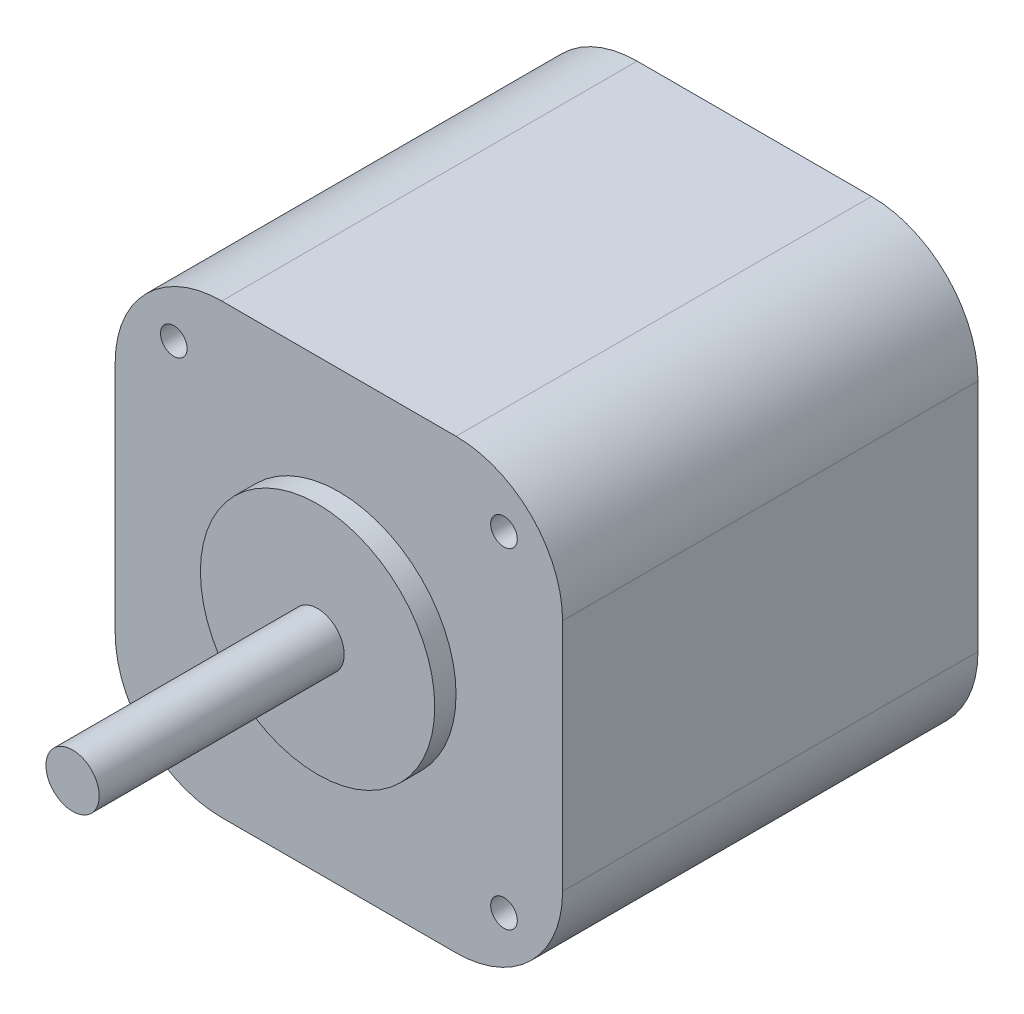
ISO-10303-21;
HEADER;
FILE_DESCRIPTION(('STEP AP214'),'2;1');
FILE_NAME('part.step','',(''),(''),'','','');
FILE_SCHEMA(('AUTOMOTIVE_DESIGN { 1 0 10303 214 1 1 1 1 }'));
ENDSEC;
DATA;
#1=APPLICATION_CONTEXT('core data for automotive mechanical design processes');
#2=APPLICATION_PROTOCOL_DEFINITION('international standard','automotive_design',2000,#1);
#3=PRODUCT_CONTEXT('',#1,'mechanical');
#4=PRODUCT('Part','Part','',(#3));
#5=PRODUCT_RELATED_PRODUCT_CATEGORY('part','',(#4));
#6=PRODUCT_DEFINITION_FORMATION('','',#4);
#7=PRODUCT_DEFINITION_CONTEXT('part definition',#1,'design');
#8=PRODUCT_DEFINITION('design','',#6,#7);
#9=PRODUCT_DEFINITION_SHAPE('','',#8);
#10=(LENGTH_UNIT() NAMED_UNIT(*) SI_UNIT(.MILLI.,.METRE.));
#11=(NAMED_UNIT(*) PLANE_ANGLE_UNIT() SI_UNIT($,.RADIAN.));
#12=(NAMED_UNIT(*) SI_UNIT($,.STERADIAN.) SOLID_ANGLE_UNIT());
#13=UNCERTAINTY_MEASURE_WITH_UNIT(LENGTH_MEASURE(1.E-05),#10,'distance_accuracy_value','');
#14=(GEOMETRIC_REPRESENTATION_CONTEXT(3) GLOBAL_UNCERTAINTY_ASSIGNED_CONTEXT((#13)) GLOBAL_UNIT_ASSIGNED_CONTEXT((#10,
#11,#12)) REPRESENTATION_CONTEXT('',''));
#15=CARTESIAN_POINT('',(0.,0.,0.));
#16=DIRECTION('',(0.,0.,1.));
#17=DIRECTION('',(1.,0.,0.));
#18=AXIS2_PLACEMENT_3D('',#15,#16,#17);
#19=CARTESIAN_POINT('',(0.,0.,39.));
#20=DIRECTION('',(1.,0.,0.));
#21=DIRECTION('',(0.,0.,-1.));
#22=AXIS2_PLACEMENT_3D('',#19,#20,#21);
#23=PLANE('',#22);
#24=DIRECTION('',(0.,-1.,0.));
#25=VECTOR('',#24,1.);
#26=CARTESIAN_POINT('',(0.,0.,0.));
#27=LINE('',#26,#25);
#28=CARTESIAN_POINT('',(0.,32.,0.));
#29=VERTEX_POINT('',#28);
#30=CARTESIAN_POINT('',(0.,10.,0.));
#31=VERTEX_POINT('',#30);
#32=EDGE_CURVE('E150',#29,#31,#27,.T.);
#33=ORIENTED_EDGE('',*,*,#32,.T.);
#34=DIRECTION('',(0.,0.,-1.));
#35=VECTOR('',#34,1.);
#36=CARTESIAN_POINT('',(0.,10.,39.));
#37=LINE('',#36,#35);
#38=CARTESIAN_POINT('',(0.,10.,39.));
#39=VERTEX_POINT('',#38);
#40=EDGE_CURVE('E187',#31,#39,#37,.F.);
#41=ORIENTED_EDGE('',*,*,#40,.T.);
#42=DIRECTION('',(0.,-1.,0.));
#43=VECTOR('',#42,1.);
#44=CARTESIAN_POINT('',(0.,0.,39.));
#45=LINE('',#44,#43);
#46=CARTESIAN_POINT('',(0.,32.,39.));
#47=VERTEX_POINT('',#46);
#48=EDGE_CURVE('E151',#47,#39,#45,.T.);
#49=ORIENTED_EDGE('',*,*,#48,.F.);
#50=DIRECTION('',(0.,0.,-1.));
#51=VECTOR('',#50,1.);
#52=CARTESIAN_POINT('',(0.,32.,39.));
#53=LINE('',#52,#51);
#54=EDGE_CURVE('E184',#47,#29,#53,.T.);
#55=ORIENTED_EDGE('',*,*,#54,.T.);
#56=EDGE_LOOP('',(#33,#41,#49,#55));
#57=FACE_BOUND('',#56,.T.);
#58=ADVANCED_FACE('F39',(#57),#23,.F.);
#59=CARTESIAN_POINT('',(0.,0.,39.));
#60=DIRECTION('',(0.,1.,0.));
#61=DIRECTION('',(0.,0.,1.));
#62=AXIS2_PLACEMENT_3D('',#59,#60,#61);
#63=PLANE('',#62);
#64=DIRECTION('',(1.,0.,0.));
#65=VECTOR('',#64,1.);
#66=CARTESIAN_POINT('',(0.,0.,39.));
#67=LINE('',#66,#65);
#68=CARTESIAN_POINT('',(10.,0.,39.));
#69=VERTEX_POINT('',#68);
#70=CARTESIAN_POINT('',(32.,0.,39.));
#71=VERTEX_POINT('',#70);
#72=EDGE_CURVE('E154',#69,#71,#67,.T.);
#73=ORIENTED_EDGE('',*,*,#72,.F.);
#74=DIRECTION('',(0.,0.,-1.));
#75=VECTOR('',#74,1.);
#76=CARTESIAN_POINT('',(10.,0.,39.));
#77=LINE('',#76,#75);
#78=CARTESIAN_POINT('',(10.,0.,0.));
#79=VERTEX_POINT('',#78);
#80=EDGE_CURVE('E173',#69,#79,#77,.T.);
#81=ORIENTED_EDGE('',*,*,#80,.T.);
#82=DIRECTION('',(1.,0.,0.));
#83=VECTOR('',#82,1.);
#84=CARTESIAN_POINT('',(0.,0.,0.));
#85=LINE('',#84,#83);
#86=CARTESIAN_POINT('',(32.,0.,0.));
#87=VERTEX_POINT('',#86);
#88=EDGE_CURVE('E165',#79,#87,#85,.T.);
#89=ORIENTED_EDGE('',*,*,#88,.T.);
#90=DIRECTION('',(0.,0.,-1.));
#91=VECTOR('',#90,1.);
#92=CARTESIAN_POINT('',(32.,0.,39.));
#93=LINE('',#92,#91);
#94=EDGE_CURVE('E162',#87,#71,#93,.F.);
#95=ORIENTED_EDGE('',*,*,#94,.T.);
#96=EDGE_LOOP('',(#73,#81,#89,#95));
#97=FACE_BOUND('',#96,.T.);
#98=ADVANCED_FACE('F226',(#97),#63,.F.);
#99=CARTESIAN_POINT('',(42.,0.,39.));
#100=DIRECTION('',(-1.,0.,0.));
#101=DIRECTION('',(0.,0.,1.));
#102=AXIS2_PLACEMENT_3D('',#99,#100,#101);
#103=PLANE('',#102);
#104=DIRECTION('',(0.,1.,0.));
#105=VECTOR('',#104,1.);
#106=CARTESIAN_POINT('',(42.,0.,39.));
#107=LINE('',#106,#105);
#108=CARTESIAN_POINT('',(42.,10.,39.));
#109=VERTEX_POINT('',#108);
#110=CARTESIAN_POINT('',(42.,32.,39.));
#111=VERTEX_POINT('',#110);
#112=EDGE_CURVE('E158',#109,#111,#107,.T.);
#113=ORIENTED_EDGE('',*,*,#112,.F.);
#114=DIRECTION('',(0.,0.,-1.));
#115=VECTOR('',#114,1.);
#116=CARTESIAN_POINT('',(42.,10.,39.));
#117=LINE('',#116,#115);
#118=CARTESIAN_POINT('',(42.,10.,0.));
#119=VERTEX_POINT('',#118);
#120=EDGE_CURVE('E198',#109,#119,#117,.T.);
#121=ORIENTED_EDGE('',*,*,#120,.T.);
#122=DIRECTION('',(0.,1.,0.));
#123=VECTOR('',#122,1.);
#124=CARTESIAN_POINT('',(42.,0.,0.));
#125=LINE('',#124,#123);
#126=CARTESIAN_POINT('',(42.,32.,0.));
#127=VERTEX_POINT('',#126);
#128=EDGE_CURVE('E168',#119,#127,#125,.T.);
#129=ORIENTED_EDGE('',*,*,#128,.T.);
#130=DIRECTION('',(0.,0.,-1.));
#131=VECTOR('',#130,1.);
#132=CARTESIAN_POINT('',(42.,32.,39.));
#133=LINE('',#132,#131);
#134=EDGE_CURVE('E196',#127,#111,#133,.F.);
#135=ORIENTED_EDGE('',*,*,#134,.T.);
#136=EDGE_LOOP('',(#113,#121,#129,#135));
#137=FACE_BOUND('',#136,.T.);
#138=ADVANCED_FACE('F234',(#137),#103,.F.);
#139=CARTESIAN_POINT('',(0.,42.,39.));
#140=DIRECTION('',(0.,-1.,0.));
#141=DIRECTION('',(0.,0.,-1.));
#142=AXIS2_PLACEMENT_3D('',#139,#140,#141);
#143=PLANE('',#142);
#144=DIRECTION('',(-1.,0.,0.));
#145=VECTOR('',#144,1.);
#146=CARTESIAN_POINT('',(0.,42.,0.));
#147=LINE('',#146,#145);
#148=CARTESIAN_POINT('',(32.,42.,0.));
#149=VERTEX_POINT('',#148);
#150=CARTESIAN_POINT('',(10.,42.,0.));
#151=VERTEX_POINT('',#150);
#152=EDGE_CURVE('E155',#149,#151,#147,.T.);
#153=ORIENTED_EDGE('',*,*,#152,.T.);
#154=DIRECTION('',(0.,0.,-1.));
#155=VECTOR('',#154,1.);
#156=CARTESIAN_POINT('',(10.,42.,39.));
#157=LINE('',#156,#155);
#158=CARTESIAN_POINT('',(10.,42.,39.));
#159=VERTEX_POINT('',#158);
#160=EDGE_CURVE('E47',#151,#159,#157,.F.);
#161=ORIENTED_EDGE('',*,*,#160,.T.);
#162=DIRECTION('',(-1.,0.,0.));
#163=VECTOR('',#162,1.);
#164=CARTESIAN_POINT('',(0.,42.,39.));
#165=LINE('',#164,#163);
#166=CARTESIAN_POINT('',(32.,42.,39.));
#167=VERTEX_POINT('',#166);
#168=EDGE_CURVE('E160',#167,#159,#165,.T.);
#169=ORIENTED_EDGE('',*,*,#168,.F.);
#170=DIRECTION('',(0.,0.,-1.));
#171=VECTOR('',#170,1.);
#172=CARTESIAN_POINT('',(32.,42.,39.));
#173=LINE('',#172,#171);
#174=EDGE_CURVE('E201',#167,#149,#173,.T.);
#175=ORIENTED_EDGE('',*,*,#174,.T.);
#176=EDGE_LOOP('',(#153,#161,#169,#175));
#177=FACE_BOUND('',#176,.T.);
#178=ADVANCED_FACE('F205',(#177),#143,.F.);
#179=CARTESIAN_POINT('',(0.,0.,39.));
#180=DIRECTION('',(0.,0.,-1.));
#181=DIRECTION('',(-1.,0.,0.));
#182=AXIS2_PLACEMENT_3D('',#179,#180,#181);
#183=PLANE('',#182);
#184=CARTESIAN_POINT('',(21.,21.,39.));
#185=DIRECTION('',(0.,0.,-1.));
#186=DIRECTION('',(-1.,0.,0.));
#187=AXIS2_PLACEMENT_3D('',#184,#185,#186);
#188=CIRCLE('',#187,11.);
#189=CARTESIAN_POINT('',(10.,21.,39.));
#190=VERTEX_POINT('',#189);
#191=EDGE_CURVE('E11',#190,#190,#188,.F.);
#192=ORIENTED_EDGE('',*,*,#191,.F.);
#193=EDGE_LOOP('',(#192));
#194=FACE_BOUND('',#193,.T.);
#195=CARTESIAN_POINT('',(5.5,36.5,39.));
#196=DIRECTION('',(0.,0.,1.));
#197=DIRECTION('',(1.,0.,0.));
#198=AXIS2_PLACEMENT_3D('',#195,#196,#197);
#199=CIRCLE('',#198,1.24999999999999);
#200=CARTESIAN_POINT('',(6.74999999999998,36.5,39.));
#201=VERTEX_POINT('',#200);
#202=EDGE_CURVE('E126',#201,#201,#199,.T.);
#203=ORIENTED_EDGE('',*,*,#202,.F.);
#204=EDGE_LOOP('',(#203));
#205=FACE_BOUND('',#204,.T.);
#206=CARTESIAN_POINT('',(36.5,36.5,39.));
#207=DIRECTION('',(0.,0.,1.));
#208=DIRECTION('',(1.,0.,0.));
#209=AXIS2_PLACEMENT_3D('',#206,#207,#208);
#210=CIRCLE('',#209,1.24999999999999);
#211=CARTESIAN_POINT('',(37.75,36.5,39.));
#212=VERTEX_POINT('',#211);
#213=EDGE_CURVE('E125',#212,#212,#210,.T.);
#214=ORIENTED_EDGE('',*,*,#213,.F.);
#215=EDGE_LOOP('',(#214));
#216=FACE_BOUND('',#215,.T.);
#217=CARTESIAN_POINT('',(36.5,5.50000000000001,39.));
#218=DIRECTION('',(0.,0.,1.));
#219=DIRECTION('',(1.,0.,0.));
#220=AXIS2_PLACEMENT_3D('',#217,#218,#219);
#221=CIRCLE('',#220,1.24999999999999);
#222=CARTESIAN_POINT('',(37.75,5.50000000000001,39.));
#223=VERTEX_POINT('',#222);
#224=EDGE_CURVE('E138',#223,#223,#221,.T.);
#225=ORIENTED_EDGE('',*,*,#224,.F.);
#226=EDGE_LOOP('',(#225));
#227=FACE_BOUND('',#226,.T.);
#228=CARTESIAN_POINT('',(5.5,5.5,39.));
#229=DIRECTION('',(0.,0.,1.));
#230=DIRECTION('',(1.,0.,0.));
#231=AXIS2_PLACEMENT_3D('',#228,#229,#230);
#232=CIRCLE('',#231,1.24999999999999);
#233=CARTESIAN_POINT('',(6.74999999999999,5.5,39.));
#234=VERTEX_POINT('',#233);
#235=EDGE_CURVE('E144',#234,#234,#232,.T.);
#236=ORIENTED_EDGE('',*,*,#235,.F.);
#237=EDGE_LOOP('',(#236));
#238=FACE_BOUND('',#237,.T.);
#239=ORIENTED_EDGE('',*,*,#48,.T.);
#240=CARTESIAN_POINT('',(10.,10.,39.));
#241=DIRECTION('',(0.,0.,-1.));
#242=DIRECTION('',(-1.,0.,0.));
#243=AXIS2_PLACEMENT_3D('',#240,#241,#242);
#244=CIRCLE('',#243,10.);
#245=EDGE_CURVE('E194',#39,#69,#244,.F.);
#246=ORIENTED_EDGE('',*,*,#245,.T.);
#247=ORIENTED_EDGE('',*,*,#72,.T.);
#248=CARTESIAN_POINT('',(32.,10.,39.));
#249=DIRECTION('',(0.,0.,-1.));
#250=DIRECTION('',(-1.,0.,0.));
#251=AXIS2_PLACEMENT_3D('',#248,#249,#250);
#252=CIRCLE('',#251,10.);
#253=EDGE_CURVE('E192',#71,#109,#252,.F.);
#254=ORIENTED_EDGE('',*,*,#253,.T.);
#255=ORIENTED_EDGE('',*,*,#112,.T.);
#256=CARTESIAN_POINT('',(32.,32.,39.));
#257=DIRECTION('',(0.,0.,-1.));
#258=DIRECTION('',(-1.,0.,0.));
#259=AXIS2_PLACEMENT_3D('',#256,#257,#258);
#260=CIRCLE('',#259,10.);
#261=EDGE_CURVE('E60',#111,#167,#260,.F.);
#262=ORIENTED_EDGE('',*,*,#261,.T.);
#263=ORIENTED_EDGE('',*,*,#168,.T.);
#264=CARTESIAN_POINT('',(10.,32.,39.));
#265=DIRECTION('',(0.,0.,-1.));
#266=DIRECTION('',(-1.,0.,0.));
#267=AXIS2_PLACEMENT_3D('',#264,#265,#266);
#268=CIRCLE('',#267,10.);
#269=EDGE_CURVE('E190',#159,#47,#268,.F.);
#270=ORIENTED_EDGE('',*,*,#269,.T.);
#271=EDGE_LOOP('',(#239,#246,#247,#254,#255,#262,#263,#270));
#272=FACE_BOUND('',#271,.T.);
#273=ADVANCED_FACE('F220',(#194,#205,#216,#227,#238,#272),#183,.F.);
#274=CARTESIAN_POINT('',(0.,0.,0.));
#275=DIRECTION('',(0.,0.,-1.));
#276=DIRECTION('',(-1.,0.,0.));
#277=AXIS2_PLACEMENT_3D('',#274,#275,#276);
#278=PLANE('',#277);
#279=ORIENTED_EDGE('',*,*,#88,.F.);
#280=CARTESIAN_POINT('',(10.,10.,0.));
#281=DIRECTION('',(0.,0.,-1.));
#282=DIRECTION('',(-1.,0.,0.));
#283=AXIS2_PLACEMENT_3D('',#280,#281,#282);
#284=CIRCLE('',#283,10.);
#285=EDGE_CURVE('E182',#79,#31,#284,.T.);
#286=ORIENTED_EDGE('',*,*,#285,.T.);
#287=ORIENTED_EDGE('',*,*,#32,.F.);
#288=CARTESIAN_POINT('',(10.,32.,0.));
#289=DIRECTION('',(0.,0.,-1.));
#290=DIRECTION('',(-1.,0.,0.));
#291=AXIS2_PLACEMENT_3D('',#288,#289,#290);
#292=CIRCLE('',#291,10.);
#293=EDGE_CURVE('E178',#29,#151,#292,.T.);
#294=ORIENTED_EDGE('',*,*,#293,.T.);
#295=ORIENTED_EDGE('',*,*,#152,.F.);
#296=CARTESIAN_POINT('',(32.,32.,0.));
#297=DIRECTION('',(0.,0.,-1.));
#298=DIRECTION('',(-1.,0.,0.));
#299=AXIS2_PLACEMENT_3D('',#296,#297,#298);
#300=CIRCLE('',#299,10.);
#301=EDGE_CURVE('E176',#149,#127,#300,.T.);
#302=ORIENTED_EDGE('',*,*,#301,.T.);
#303=ORIENTED_EDGE('',*,*,#128,.F.);
#304=CARTESIAN_POINT('',(32.,10.,0.));
#305=DIRECTION('',(0.,0.,-1.));
#306=DIRECTION('',(-1.,0.,0.));
#307=AXIS2_PLACEMENT_3D('',#304,#305,#306);
#308=CIRCLE('',#307,10.);
#309=EDGE_CURVE('E180',#119,#87,#308,.T.);
#310=ORIENTED_EDGE('',*,*,#309,.T.);
#311=EDGE_LOOP('',(#279,#286,#287,#294,#295,#302,#303,#310));
#312=FACE_BOUND('',#311,.T.);
#313=ADVANCED_FACE('F209',(#312),#278,.T.);
#314=CARTESIAN_POINT('',(10.,10.,39.));
#315=DIRECTION('',(0.,0.,-1.));
#316=DIRECTION('',(-1.,0.,0.));
#317=AXIS2_PLACEMENT_3D('',#314,#315,#316);
#318=CYLINDRICAL_SURFACE('',#317,10.);
#319=ORIENTED_EDGE('',*,*,#245,.F.);
#320=ORIENTED_EDGE('',*,*,#40,.F.);
#321=ORIENTED_EDGE('',*,*,#285,.F.);
#322=ORIENTED_EDGE('',*,*,#80,.F.);
#323=EDGE_LOOP('',(#319,#320,#321,#322));
#324=FACE_BOUND('',#323,.T.);
#325=ADVANCED_FACE('F224',(#324),#318,.T.);
#326=CARTESIAN_POINT('',(32.,10.,39.));
#327=DIRECTION('',(0.,0.,-1.));
#328=DIRECTION('',(-1.,0.,0.));
#329=AXIS2_PLACEMENT_3D('',#326,#327,#328);
#330=CYLINDRICAL_SURFACE('',#329,10.);
#331=ORIENTED_EDGE('',*,*,#253,.F.);
#332=ORIENTED_EDGE('',*,*,#94,.F.);
#333=ORIENTED_EDGE('',*,*,#309,.F.);
#334=ORIENTED_EDGE('',*,*,#120,.F.);
#335=EDGE_LOOP('',(#331,#332,#333,#334));
#336=FACE_BOUND('',#335,.T.);
#337=ADVANCED_FACE('F231',(#336),#330,.T.);
#338=CARTESIAN_POINT('',(10.,32.,39.));
#339=DIRECTION('',(0.,0.,-1.));
#340=DIRECTION('',(-1.,0.,0.));
#341=AXIS2_PLACEMENT_3D('',#338,#339,#340);
#342=CYLINDRICAL_SURFACE('',#341,10.);
#343=ORIENTED_EDGE('',*,*,#269,.F.);
#344=ORIENTED_EDGE('',*,*,#160,.F.);
#345=ORIENTED_EDGE('',*,*,#293,.F.);
#346=ORIENTED_EDGE('',*,*,#54,.F.);
#347=EDGE_LOOP('',(#343,#344,#345,#346));
#348=FACE_BOUND('',#347,.T.);
#349=ADVANCED_FACE('F215',(#348),#342,.T.);
#350=CARTESIAN_POINT('',(32.,32.,39.));
#351=DIRECTION('',(0.,0.,-1.));
#352=DIRECTION('',(-1.,0.,0.));
#353=AXIS2_PLACEMENT_3D('',#350,#351,#352);
#354=CYLINDRICAL_SURFACE('',#353,10.);
#355=ORIENTED_EDGE('',*,*,#261,.F.);
#356=ORIENTED_EDGE('',*,*,#134,.F.);
#357=ORIENTED_EDGE('',*,*,#301,.F.);
#358=ORIENTED_EDGE('',*,*,#174,.F.);
#359=EDGE_LOOP('',(#355,#356,#357,#358));
#360=FACE_BOUND('',#359,.T.);
#361=ADVANCED_FACE('F41',(#360),#354,.T.);
#362=CARTESIAN_POINT('',(5.5,5.5,31.5));
#363=DIRECTION('',(0.,0.,1.));
#364=DIRECTION('',(1.,0.,0.));
#365=AXIS2_PLACEMENT_3D('',#362,#363,#364);
#366=CONICAL_SURFACE('',#365,1.24999999999999,1.02974425867665);
#367=CARTESIAN_POINT('',(5.5,5.5,30.7489242262155));
#368=VERTEX_POINT('',#367);
#369=VERTEX_LOOP('',#368);
#370=FACE_BOUND('',#369,.T.);
#371=CARTESIAN_POINT('',(5.5,5.5,31.5));
#372=DIRECTION('',(0.,0.,1.));
#373=DIRECTION('',(1.,0.,0.));
#374=AXIS2_PLACEMENT_3D('',#371,#372,#373);
#375=CIRCLE('',#374,1.24999999999999);
#376=CARTESIAN_POINT('',(6.74999999999998,5.5,31.5));
#377=VERTEX_POINT('',#376);
#378=EDGE_CURVE('E147',#377,#377,#375,.T.);
#379=ORIENTED_EDGE('',*,*,#378,.T.);
#380=EDGE_LOOP('',(#379));
#381=FACE_BOUND('',#380,.T.);
#382=ADVANCED_FACE('F237',(#370,#381),#366,.F.);
#383=CARTESIAN_POINT('',(5.5,5.5,39.));
#384=DIRECTION('',(0.,0.,1.));
#385=DIRECTION('',(1.,0.,0.));
#386=AXIS2_PLACEMENT_3D('',#383,#384,#385);
#387=CYLINDRICAL_SURFACE('',#386,1.24999999999999);
#388=ORIENTED_EDGE('',*,*,#378,.F.);
#389=EDGE_LOOP('',(#388));
#390=FACE_BOUND('',#389,.T.);
#391=ORIENTED_EDGE('',*,*,#235,.T.);
#392=EDGE_LOOP('',(#391));
#393=FACE_BOUND('',#392,.T.);
#394=ADVANCED_FACE('F242',(#390,#393),#387,.F.);
#395=CARTESIAN_POINT('',(36.5,5.50000000000001,31.5));
#396=DIRECTION('',(0.,0.,1.));
#397=DIRECTION('',(1.,0.,0.));
#398=AXIS2_PLACEMENT_3D('',#395,#396,#397);
#399=CONICAL_SURFACE('',#398,1.24999999999999,1.02974425867665);
#400=CARTESIAN_POINT('',(36.5,5.50000000000001,30.7489242262155));
#401=VERTEX_POINT('',#400);
#402=VERTEX_LOOP('',#401);
#403=FACE_BOUND('',#402,.T.);
#404=CARTESIAN_POINT('',(36.5,5.50000000000001,31.5));
#405=DIRECTION('',(0.,0.,1.));
#406=DIRECTION('',(1.,0.,0.));
#407=AXIS2_PLACEMENT_3D('',#404,#405,#406);
#408=CIRCLE('',#407,1.24999999999999);
#409=CARTESIAN_POINT('',(37.75,5.50000000000001,31.5));
#410=VERTEX_POINT('',#409);
#411=EDGE_CURVE('E141',#410,#410,#408,.T.);
#412=ORIENTED_EDGE('',*,*,#411,.T.);
#413=EDGE_LOOP('',(#412));
#414=FACE_BOUND('',#413,.T.);
#415=ADVANCED_FACE('F285',(#403,#414),#399,.F.);
#416=CARTESIAN_POINT('',(36.5,5.50000000000001,39.));
#417=DIRECTION('',(0.,0.,1.));
#418=DIRECTION('',(1.,0.,0.));
#419=AXIS2_PLACEMENT_3D('',#416,#417,#418);
#420=CYLINDRICAL_SURFACE('',#419,1.24999999999999);
#421=ORIENTED_EDGE('',*,*,#411,.F.);
#422=EDGE_LOOP('',(#421));
#423=FACE_BOUND('',#422,.T.);
#424=ORIENTED_EDGE('',*,*,#224,.T.);
#425=EDGE_LOOP('',(#424));
#426=FACE_BOUND('',#425,.T.);
#427=ADVANCED_FACE('F297',(#423,#426),#420,.F.);
#428=CARTESIAN_POINT('',(36.5,36.5,31.5));
#429=DIRECTION('',(0.,0.,1.));
#430=DIRECTION('',(1.,0.,0.));
#431=AXIS2_PLACEMENT_3D('',#428,#429,#430);
#432=CONICAL_SURFACE('',#431,1.24999999999999,1.02974425867665);
#433=CARTESIAN_POINT('',(36.5,36.5,30.7489242262155));
#434=VERTEX_POINT('',#433);
#435=VERTEX_LOOP('',#434);
#436=FACE_BOUND('',#435,.T.);
#437=CARTESIAN_POINT('',(36.5,36.5,31.5));
#438=DIRECTION('',(0.,0.,1.));
#439=DIRECTION('',(1.,0.,0.));
#440=AXIS2_PLACEMENT_3D('',#437,#438,#439);
#441=CIRCLE('',#440,1.24999999999999);
#442=CARTESIAN_POINT('',(37.75,36.5,31.5));
#443=VERTEX_POINT('',#442);
#444=EDGE_CURVE('E129',#443,#443,#441,.T.);
#445=ORIENTED_EDGE('',*,*,#444,.T.);
#446=EDGE_LOOP('',(#445));
#447=FACE_BOUND('',#446,.T.);
#448=ADVANCED_FACE('F307',(#436,#447),#432,.F.);
#449=CARTESIAN_POINT('',(36.5,36.5,39.));
#450=DIRECTION('',(0.,0.,1.));
#451=DIRECTION('',(1.,0.,0.));
#452=AXIS2_PLACEMENT_3D('',#449,#450,#451);
#453=CYLINDRICAL_SURFACE('',#452,1.24999999999999);
#454=ORIENTED_EDGE('',*,*,#444,.F.);
#455=EDGE_LOOP('',(#454));
#456=FACE_BOUND('',#455,.T.);
#457=ORIENTED_EDGE('',*,*,#213,.T.);
#458=EDGE_LOOP('',(#457));
#459=FACE_BOUND('',#458,.T.);
#460=ADVANCED_FACE('F119',(#456,#459),#453,.F.);
#461=CARTESIAN_POINT('',(5.5,36.5,31.5));
#462=DIRECTION('',(0.,0.,1.));
#463=DIRECTION('',(1.,0.,0.));
#464=AXIS2_PLACEMENT_3D('',#461,#462,#463);
#465=CONICAL_SURFACE('',#464,1.24999999999999,1.02974425867665);
#466=CARTESIAN_POINT('',(5.49999999999999,36.5,30.7489242262155));
#467=VERTEX_POINT('',#466);
#468=VERTEX_LOOP('',#467);
#469=FACE_BOUND('',#468,.T.);
#470=CARTESIAN_POINT('',(5.5,36.5,31.5));
#471=DIRECTION('',(0.,0.,1.));
#472=DIRECTION('',(1.,0.,0.));
#473=AXIS2_PLACEMENT_3D('',#470,#471,#472);
#474=CIRCLE('',#473,1.24999999999999);
#475=CARTESIAN_POINT('',(6.74999999999998,36.5,31.5));
#476=VERTEX_POINT('',#475);
#477=EDGE_CURVE('E123',#476,#476,#474,.T.);
#478=ORIENTED_EDGE('',*,*,#477,.T.);
#479=EDGE_LOOP('',(#478));
#480=FACE_BOUND('',#479,.T.);
#481=ADVANCED_FACE('F115',(#469,#480),#465,.F.);
#482=CARTESIAN_POINT('',(5.5,36.5,39.));
#483=DIRECTION('',(0.,0.,1.));
#484=DIRECTION('',(1.,0.,0.));
#485=AXIS2_PLACEMENT_3D('',#482,#483,#484);
#486=CYLINDRICAL_SURFACE('',#485,1.24999999999999);
#487=ORIENTED_EDGE('',*,*,#477,.F.);
#488=EDGE_LOOP('',(#487));
#489=FACE_BOUND('',#488,.T.);
#490=ORIENTED_EDGE('',*,*,#202,.T.);
#491=EDGE_LOOP('',(#490));
#492=FACE_BOUND('',#491,.T.);
#493=ADVANCED_FACE('F118',(#489,#492),#486,.F.);
#494=CARTESIAN_POINT('',(21.,21.,41.));
#495=DIRECTION('',(0.,0.,-1.));
#496=DIRECTION('',(-1.,0.,0.));
#497=AXIS2_PLACEMENT_3D('',#494,#495,#496);
#498=CYLINDRICAL_SURFACE('',#497,11.);
#499=CARTESIAN_POINT('',(21.,21.,41.));
#500=DIRECTION('',(0.,0.,1.));
#501=DIRECTION('',(1.,0.,0.));
#502=AXIS2_PLACEMENT_3D('',#499,#500,#501);
#503=CIRCLE('',#502,11.);
#504=CARTESIAN_POINT('',(32.,21.,41.));
#505=VERTEX_POINT('',#504);
#506=EDGE_CURVE('E132',#505,#505,#503,.T.);
#507=ORIENTED_EDGE('',*,*,#506,.F.);
#508=EDGE_LOOP('',(#507));
#509=FACE_BOUND('',#508,.T.);
#510=ORIENTED_EDGE('',*,*,#191,.T.);
#511=EDGE_LOOP('',(#510));
#512=FACE_BOUND('',#511,.T.);
#513=ADVANCED_FACE('F345',(#509,#512),#498,.T.);
#514=CARTESIAN_POINT('',(21.,21.,41.));
#515=DIRECTION('',(0.,0.,1.));
#516=DIRECTION('',(1.,0.,0.));
#517=AXIS2_PLACEMENT_3D('',#514,#515,#516);
#518=PLANE('',#517);
#519=CARTESIAN_POINT('',(21.,21.,41.));
#520=DIRECTION('',(0.,0.,1.));
#521=DIRECTION('',(1.,0.,0.));
#522=AXIS2_PLACEMENT_3D('',#519,#520,#521);
#523=CIRCLE('',#522,2.5);
#524=CARTESIAN_POINT('',(23.5,21.,41.));
#525=VERTEX_POINT('',#524);
#526=EDGE_CURVE('E439',#525,#525,#523,.T.);
#527=ORIENTED_EDGE('',*,*,#526,.F.);
#528=EDGE_LOOP('',(#527));
#529=FACE_BOUND('',#528,.T.);
#530=ORIENTED_EDGE('',*,*,#506,.T.);
#531=EDGE_LOOP('',(#530));
#532=FACE_BOUND('',#531,.T.);
#533=ADVANCED_FACE('F367',(#529,#532),#518,.T.);
#534=CARTESIAN_POINT('',(21.,21.,64.));
#535=DIRECTION('',(0.,0.,-1.));
#536=DIRECTION('',(-1.,0.,0.));
#537=AXIS2_PLACEMENT_3D('',#534,#535,#536);
#538=CYLINDRICAL_SURFACE('',#537,2.5);
#539=CARTESIAN_POINT('',(21.,21.,64.));
#540=DIRECTION('',(0.,0.,1.));
#541=DIRECTION('',(1.,0.,0.));
#542=AXIS2_PLACEMENT_3D('',#539,#540,#541);
#543=CIRCLE('',#542,2.5);
#544=CARTESIAN_POINT('',(23.5,21.,64.));
#545=VERTEX_POINT('',#544);
#546=EDGE_CURVE('E438',#545,#545,#543,.T.);
#547=ORIENTED_EDGE('',*,*,#546,.F.);
#548=EDGE_LOOP('',(#547));
#549=FACE_BOUND('',#548,.T.);
#550=ORIENTED_EDGE('',*,*,#526,.T.);
#551=EDGE_LOOP('',(#550));
#552=FACE_BOUND('',#551,.T.);
#553=ADVANCED_FACE('F377',(#549,#552),#538,.T.);
#554=CARTESIAN_POINT('',(21.,21.,64.));
#555=DIRECTION('',(0.,0.,1.));
#556=DIRECTION('',(1.,0.,0.));
#557=AXIS2_PLACEMENT_3D('',#554,#555,#556);
#558=PLANE('',#557);
#559=ORIENTED_EDGE('',*,*,#546,.T.);
#560=EDGE_LOOP('',(#559));
#561=FACE_BOUND('',#560,.T.);
#562=ADVANCED_FACE('F387',(#561),#558,.T.);
#563=CLOSED_SHELL('',(#58,#98,#138,#178,#273,#313,#325,#337,#349,#361,#382,#394,#415,#427,#448,
#460,#481,#493,#513,#533,#553,#562));
#564=MANIFOLD_SOLID_BREP('B2',#563);
#565=ADVANCED_BREP_SHAPE_REPRESENTATION('',(#18,#564),#14);
#566=SHAPE_DEFINITION_REPRESENTATION(#9,#565);
ENDSEC;
END-ISO-10303-21;
